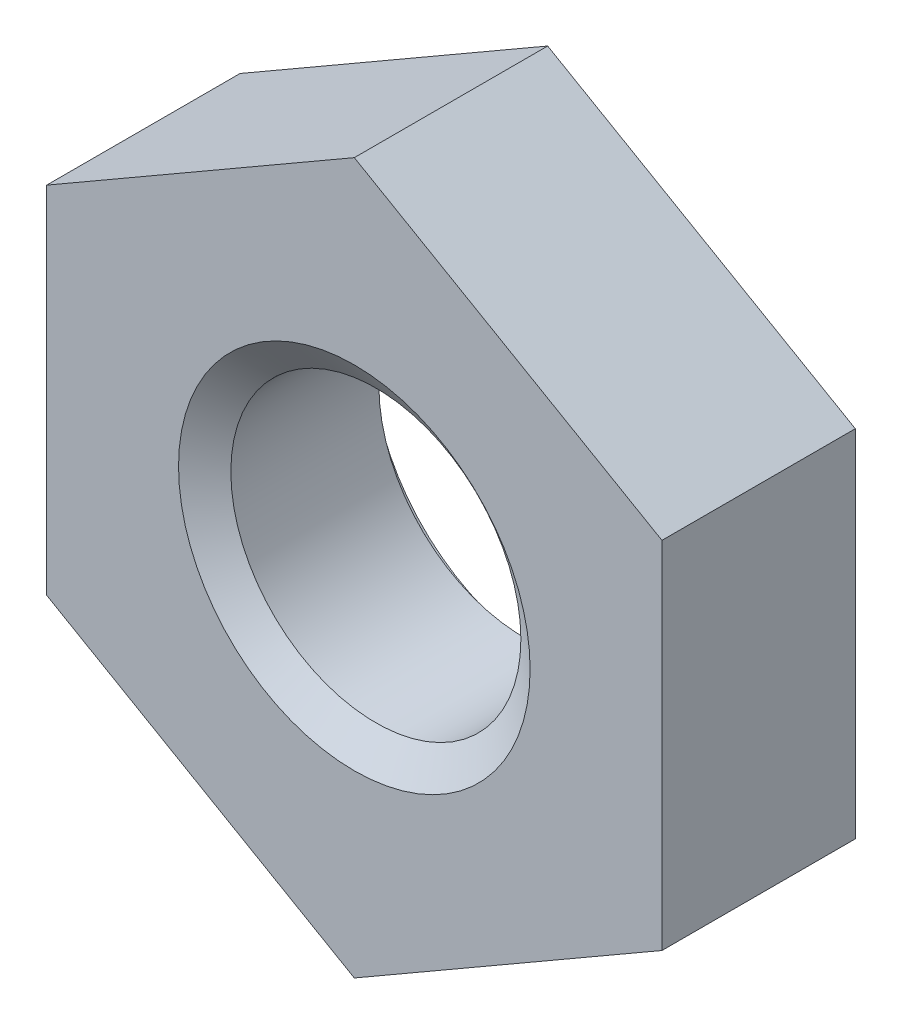
ISO-10303-21;
HEADER;
FILE_DESCRIPTION(('STEP AP214'),'2;1');
FILE_NAME('part.step','',(''),(''),'','','');
FILE_SCHEMA(('AUTOMOTIVE_DESIGN { 1 0 10303 214 1 1 1 1 }'));
ENDSEC;
DATA;
#1=APPLICATION_CONTEXT('core data for automotive mechanical design processes');
#2=APPLICATION_PROTOCOL_DEFINITION('international standard','automotive_design',2000,#1);
#3=PRODUCT_CONTEXT('',#1,'mechanical');
#4=PRODUCT('Part','Part','',(#3));
#5=PRODUCT_RELATED_PRODUCT_CATEGORY('part','',(#4));
#6=PRODUCT_DEFINITION_FORMATION('','',#4);
#7=PRODUCT_DEFINITION_CONTEXT('part definition',#1,'design');
#8=PRODUCT_DEFINITION('design','',#6,#7);
#9=PRODUCT_DEFINITION_SHAPE('','',#8);
#10=(LENGTH_UNIT() NAMED_UNIT(*) SI_UNIT(.MILLI.,.METRE.));
#11=(NAMED_UNIT(*) PLANE_ANGLE_UNIT() SI_UNIT($,.RADIAN.));
#12=(NAMED_UNIT(*) SI_UNIT($,.STERADIAN.) SOLID_ANGLE_UNIT());
#13=UNCERTAINTY_MEASURE_WITH_UNIT(LENGTH_MEASURE(1.E-05),#10,'distance_accuracy_value','');
#14=(GEOMETRIC_REPRESENTATION_CONTEXT(3) GLOBAL_UNCERTAINTY_ASSIGNED_CONTEXT((#13)) GLOBAL_UNIT_ASSIGNED_CONTEXT((#10,
#11,#12)) REPRESENTATION_CONTEXT('',''));
#15=CARTESIAN_POINT('',(0.,0.,0.));
#16=DIRECTION('',(0.,0.,1.));
#17=DIRECTION('',(1.,0.,0.));
#18=AXIS2_PLACEMENT_3D('',#15,#16,#17);
#19=CARTESIAN_POINT('',(0.,0.,-2.2));
#20=DIRECTION('',(0.,0.,1.));
#21=DIRECTION('',(1.,0.,0.));
#22=AXIS2_PLACEMENT_3D('',#19,#20,#21);
#23=CYLINDRICAL_SURFACE('',#22,1.65);
#24=CARTESIAN_POINT('',(0.,0.,-0.245072638373399));
#25=DIRECTION('',(0.,0.,1.));
#26=DIRECTION('',(1.,0.,0.));
#27=AXIS2_PLACEMENT_3D('',#24,#25,#26);
#28=CIRCLE('',#27,1.65);
#29=CARTESIAN_POINT('',(1.65,0.,-0.245072638373399));
#30=VERTEX_POINT('',#29);
#31=EDGE_CURVE('E126',#30,#30,#28,.F.);
#32=ORIENTED_EDGE('',*,*,#31,.F.);
#33=EDGE_LOOP('',(#32));
#34=FACE_BOUND('',#33,.T.);
#35=CARTESIAN_POINT('',(0.,0.,-1.9295273616266));
#36=DIRECTION('',(0.,0.,-1.));
#37=DIRECTION('',(-1.,0.,0.));
#38=AXIS2_PLACEMENT_3D('',#35,#36,#37);
#39=CIRCLE('',#38,1.65);
#40=CARTESIAN_POINT('',(-1.65,0.,-1.9295273616266));
#41=VERTEX_POINT('',#40);
#42=EDGE_CURVE('E39',#41,#41,#39,.F.);
#43=ORIENTED_EDGE('',*,*,#42,.F.);
#44=EDGE_LOOP('',(#43));
#45=FACE_BOUND('',#44,.T.);
#46=ADVANCED_FACE('F35',(#34,#45),#23,.F.);
#47=CARTESIAN_POINT('',(0.,4.04145188432738,-2.2));
#48=DIRECTION('',(-0.500000000000001,0.866025403784438,0.));
#49=DIRECTION('',(-0.866025403784438,-0.500000000000001,0.));
#50=AXIS2_PLACEMENT_3D('',#47,#48,#49);
#51=PLANE('',#50);
#52=DIRECTION('',(-0.866025403784438,-0.500000000000001,0.));
#53=VECTOR('',#52,1.);
#54=CARTESIAN_POINT('',(0.,4.04145188432738,0.));
#55=LINE('',#54,#53);
#56=CARTESIAN_POINT('',(0.,4.04145188432738,0.));
#57=VERTEX_POINT('',#56);
#58=CARTESIAN_POINT('',(-3.5,2.02072594216369,0.));
#59=VERTEX_POINT('',#58);
#60=EDGE_CURVE('E122',#57,#59,#55,.T.);
#61=ORIENTED_EDGE('',*,*,#60,.F.);
#62=DIRECTION('',(0.,0.,1.));
#63=VECTOR('',#62,1.);
#64=CARTESIAN_POINT('',(0.,4.04145188432738,-2.2));
#65=LINE('',#64,#63);
#66=CARTESIAN_POINT('',(0.,4.04145188432738,-2.2));
#67=VERTEX_POINT('',#66);
#68=EDGE_CURVE('E11',#67,#57,#65,.T.);
#69=ORIENTED_EDGE('',*,*,#68,.F.);
#70=DIRECTION('',(-0.866025403784438,-0.500000000000001,0.));
#71=VECTOR('',#70,1.);
#72=CARTESIAN_POINT('',(0.,4.04145188432738,-2.2));
#73=LINE('',#72,#71);
#74=CARTESIAN_POINT('',(-3.5,2.02072594216369,-2.2));
#75=VERTEX_POINT('',#74);
#76=EDGE_CURVE('E137',#67,#75,#73,.T.);
#77=ORIENTED_EDGE('',*,*,#76,.T.);
#78=DIRECTION('',(0.,0.,1.));
#79=VECTOR('',#78,1.);
#80=CARTESIAN_POINT('',(-3.5,2.02072594216369,-2.2));
#81=LINE('',#80,#79);
#82=EDGE_CURVE('E86',#75,#59,#81,.T.);
#83=ORIENTED_EDGE('',*,*,#82,.T.);
#84=EDGE_LOOP('',(#61,#69,#77,#83));
#85=FACE_BOUND('',#84,.T.);
#86=ADVANCED_FACE('F37',(#85),#51,.T.);
#87=CARTESIAN_POINT('',(3.5,2.02072594216369,-2.2));
#88=DIRECTION('',(0.500000000000001,0.866025403784438,0.));
#89=DIRECTION('',(-0.866025403784438,0.500000000000001,0.));
#90=AXIS2_PLACEMENT_3D('',#87,#88,#89);
#91=PLANE('',#90);
#92=DIRECTION('',(-0.866025403784438,0.500000000000001,0.));
#93=VECTOR('',#92,1.);
#94=CARTESIAN_POINT('',(3.5,2.02072594216369,0.));
#95=LINE('',#94,#93);
#96=CARTESIAN_POINT('',(3.5,2.02072594216369,0.));
#97=VERTEX_POINT('',#96);
#98=EDGE_CURVE('E135',#97,#57,#95,.T.);
#99=ORIENTED_EDGE('',*,*,#98,.F.);
#100=DIRECTION('',(0.,0.,1.));
#101=VECTOR('',#100,1.);
#102=CARTESIAN_POINT('',(3.5,2.02072594216369,-2.2));
#103=LINE('',#102,#101);
#104=CARTESIAN_POINT('',(3.5,2.02072594216369,-2.2));
#105=VERTEX_POINT('',#104);
#106=EDGE_CURVE('E45',#105,#97,#103,.T.);
#107=ORIENTED_EDGE('',*,*,#106,.F.);
#108=DIRECTION('',(-0.866025403784438,0.500000000000001,0.));
#109=VECTOR('',#108,1.);
#110=CARTESIAN_POINT('',(3.5,2.02072594216369,-2.2));
#111=LINE('',#110,#109);
#112=EDGE_CURVE('E104',#105,#67,#111,.T.);
#113=ORIENTED_EDGE('',*,*,#112,.T.);
#114=ORIENTED_EDGE('',*,*,#68,.T.);
#115=EDGE_LOOP('',(#99,#107,#113,#114));
#116=FACE_BOUND('',#115,.T.);
#117=ADVANCED_FACE('F163',(#116),#91,.T.);
#118=CARTESIAN_POINT('',(3.5,2.02072594216369,-2.2));
#119=DIRECTION('',(-1.,0.,0.));
#120=DIRECTION('',(0.,0.,1.));
#121=AXIS2_PLACEMENT_3D('',#118,#119,#120);
#122=PLANE('',#121);
#123=DIRECTION('',(0.,-1.,0.));
#124=VECTOR('',#123,1.);
#125=CARTESIAN_POINT('',(3.5,2.02072594216369,0.));
#126=LINE('',#125,#124);
#127=CARTESIAN_POINT('',(3.5,-2.02072594216369,0.));
#128=VERTEX_POINT('',#127);
#129=EDGE_CURVE('E108',#97,#128,#126,.T.);
#130=ORIENTED_EDGE('',*,*,#129,.T.);
#131=DIRECTION('',(0.,0.,1.));
#132=VECTOR('',#131,1.);
#133=CARTESIAN_POINT('',(3.5,-2.02072594216369,-2.2));
#134=LINE('',#133,#132);
#135=CARTESIAN_POINT('',(3.5,-2.02072594216369,-2.2));
#136=VERTEX_POINT('',#135);
#137=EDGE_CURVE('E106',#136,#128,#134,.T.);
#138=ORIENTED_EDGE('',*,*,#137,.F.);
#139=DIRECTION('',(0.,-1.,0.));
#140=VECTOR('',#139,1.);
#141=CARTESIAN_POINT('',(3.5,2.02072594216369,-2.2));
#142=LINE('',#141,#140);
#143=EDGE_CURVE('E97',#105,#136,#142,.T.);
#144=ORIENTED_EDGE('',*,*,#143,.F.);
#145=ORIENTED_EDGE('',*,*,#106,.T.);
#146=EDGE_LOOP('',(#130,#138,#144,#145));
#147=FACE_BOUND('',#146,.T.);
#148=ADVANCED_FACE('F107',(#147),#122,.F.);
#149=CARTESIAN_POINT('',(0.,-4.04145188432739,-2.2));
#150=DIRECTION('',(0.500000000000001,-0.866025403784438,0.));
#151=DIRECTION('',(0.866025403784438,0.500000000000001,0.));
#152=AXIS2_PLACEMENT_3D('',#149,#150,#151);
#153=PLANE('',#152);
#154=DIRECTION('',(0.866025403784438,0.500000000000001,0.));
#155=VECTOR('',#154,1.);
#156=CARTESIAN_POINT('',(0.,-4.04145188432739,0.));
#157=LINE('',#156,#155);
#158=CARTESIAN_POINT('',(0.,-4.04145188432739,0.));
#159=VERTEX_POINT('',#158);
#160=EDGE_CURVE('E132',#159,#128,#157,.T.);
#161=ORIENTED_EDGE('',*,*,#160,.F.);
#162=DIRECTION('',(0.,0.,1.));
#163=VECTOR('',#162,1.);
#164=CARTESIAN_POINT('',(0.,-4.04145188432739,-2.2));
#165=LINE('',#164,#163);
#166=CARTESIAN_POINT('',(0.,-4.04145188432739,-2.2));
#167=VERTEX_POINT('',#166);
#168=EDGE_CURVE('E112',#167,#159,#165,.T.);
#169=ORIENTED_EDGE('',*,*,#168,.F.);
#170=DIRECTION('',(0.866025403784438,0.500000000000001,0.));
#171=VECTOR('',#170,1.);
#172=CARTESIAN_POINT('',(0.,-4.04145188432739,-2.2));
#173=LINE('',#172,#171);
#174=EDGE_CURVE('E102',#167,#136,#173,.T.);
#175=ORIENTED_EDGE('',*,*,#174,.T.);
#176=ORIENTED_EDGE('',*,*,#137,.T.);
#177=EDGE_LOOP('',(#161,#169,#175,#176));
#178=FACE_BOUND('',#177,.T.);
#179=ADVANCED_FACE('F114',(#178),#153,.T.);
#180=CARTESIAN_POINT('',(-3.5,-2.02072594216369,-2.2));
#181=DIRECTION('',(-0.500000000000001,-0.866025403784438,0.));
#182=DIRECTION('',(0.866025403784438,-0.500000000000001,0.));
#183=AXIS2_PLACEMENT_3D('',#180,#181,#182);
#184=PLANE('',#183);
#185=DIRECTION('',(0.866025403784438,-0.500000000000001,0.));
#186=VECTOR('',#185,1.);
#187=CARTESIAN_POINT('',(-3.5,-2.02072594216369,0.));
#188=LINE('',#187,#186);
#189=CARTESIAN_POINT('',(-3.5,-2.02072594216369,0.));
#190=VERTEX_POINT('',#189);
#191=EDGE_CURVE('E129',#190,#159,#188,.T.);
#192=ORIENTED_EDGE('',*,*,#191,.F.);
#193=DIRECTION('',(0.,0.,1.));
#194=VECTOR('',#193,1.);
#195=CARTESIAN_POINT('',(-3.5,-2.02072594216369,-2.2));
#196=LINE('',#195,#194);
#197=CARTESIAN_POINT('',(-3.5,-2.02072594216369,-2.2));
#198=VERTEX_POINT('',#197);
#199=EDGE_CURVE('E141',#198,#190,#196,.T.);
#200=ORIENTED_EDGE('',*,*,#199,.F.);
#201=DIRECTION('',(0.866025403784438,-0.500000000000001,0.));
#202=VECTOR('',#201,1.);
#203=CARTESIAN_POINT('',(-3.5,-2.02072594216369,-2.2));
#204=LINE('',#203,#202);
#205=EDGE_CURVE('E115',#198,#167,#204,.T.);
#206=ORIENTED_EDGE('',*,*,#205,.T.);
#207=ORIENTED_EDGE('',*,*,#168,.T.);
#208=EDGE_LOOP('',(#192,#200,#206,#207));
#209=FACE_BOUND('',#208,.T.);
#210=ADVANCED_FACE('F240',(#209),#184,.T.);
#211=CARTESIAN_POINT('',(-3.5,2.02072594216369,-2.2));
#212=DIRECTION('',(-1.,0.,0.));
#213=DIRECTION('',(0.,0.,1.));
#214=AXIS2_PLACEMENT_3D('',#211,#212,#213);
#215=PLANE('',#214);
#216=DIRECTION('',(0.,-1.,0.));
#217=VECTOR('',#216,1.);
#218=CARTESIAN_POINT('',(-3.5,2.02072594216369,0.));
#219=LINE('',#218,#217);
#220=EDGE_CURVE('E125',#59,#190,#219,.T.);
#221=ORIENTED_EDGE('',*,*,#220,.F.);
#222=ORIENTED_EDGE('',*,*,#82,.F.);
#223=DIRECTION('',(0.,-1.,0.));
#224=VECTOR('',#223,1.);
#225=CARTESIAN_POINT('',(-3.5,2.02072594216369,-2.2));
#226=LINE('',#225,#224);
#227=EDGE_CURVE('E117',#75,#198,#226,.T.);
#228=ORIENTED_EDGE('',*,*,#227,.T.);
#229=ORIENTED_EDGE('',*,*,#199,.T.);
#230=EDGE_LOOP('',(#221,#222,#228,#229));
#231=FACE_BOUND('',#230,.T.);
#232=ADVANCED_FACE('F159',(#231),#215,.T.);
#233=CARTESIAN_POINT('',(0.,4.04145188432738,-2.2));
#234=DIRECTION('',(0.,0.,-1.));
#235=DIRECTION('',(-1.,0.,0.));
#236=AXIS2_PLACEMENT_3D('',#233,#234,#235);
#237=PLANE('',#236);
#238=CARTESIAN_POINT('',(0.,0.,-2.2));
#239=DIRECTION('',(0.,0.,-1.));
#240=DIRECTION('',(-1.,0.,0.));
#241=AXIS2_PLACEMENT_3D('',#238,#239,#240);
#242=CIRCLE('',#241,2.);
#243=CARTESIAN_POINT('',(-2.,0.,-2.2));
#244=VERTEX_POINT('',#243);
#245=EDGE_CURVE('E146',#244,#244,#242,.F.);
#246=ORIENTED_EDGE('',*,*,#245,.T.);
#247=EDGE_LOOP('',(#246));
#248=FACE_BOUND('',#247,.T.);
#249=ORIENTED_EDGE('',*,*,#76,.F.);
#250=ORIENTED_EDGE('',*,*,#112,.F.);
#251=ORIENTED_EDGE('',*,*,#143,.T.);
#252=ORIENTED_EDGE('',*,*,#174,.F.);
#253=ORIENTED_EDGE('',*,*,#205,.F.);
#254=ORIENTED_EDGE('',*,*,#227,.F.);
#255=EDGE_LOOP('',(#249,#250,#251,#252,#253,#254));
#256=FACE_BOUND('',#255,.T.);
#257=ADVANCED_FACE('F99',(#248,#256),#237,.T.);
#258=CARTESIAN_POINT('',(0.,4.04145188432738,0.));
#259=DIRECTION('',(0.,0.,-1.));
#260=DIRECTION('',(-1.,0.,0.));
#261=AXIS2_PLACEMENT_3D('',#258,#259,#260);
#262=PLANE('',#261);
#263=CARTESIAN_POINT('',(0.,0.,0.));
#264=DIRECTION('',(0.,0.,1.));
#265=DIRECTION('',(1.,0.,0.));
#266=AXIS2_PLACEMENT_3D('',#263,#264,#265);
#267=CIRCLE('',#266,2.);
#268=CARTESIAN_POINT('',(2.,0.,0.));
#269=VERTEX_POINT('',#268);
#270=EDGE_CURVE('E145',#269,#269,#267,.T.);
#271=ORIENTED_EDGE('',*,*,#270,.F.);
#272=EDGE_LOOP('',(#271));
#273=FACE_BOUND('',#272,.T.);
#274=ORIENTED_EDGE('',*,*,#60,.T.);
#275=ORIENTED_EDGE('',*,*,#220,.T.);
#276=ORIENTED_EDGE('',*,*,#191,.T.);
#277=ORIENTED_EDGE('',*,*,#160,.T.);
#278=ORIENTED_EDGE('',*,*,#129,.F.);
#279=ORIENTED_EDGE('',*,*,#98,.T.);
#280=EDGE_LOOP('',(#274,#275,#276,#277,#278,#279));
#281=FACE_BOUND('',#280,.T.);
#282=ADVANCED_FACE('F162',(#273,#281),#262,.F.);
#283=CARTESIAN_POINT('',(0.,0.,-0.269579902210739));
#284=DIRECTION('',(0.,0.,1.));
#285=DIRECTION('',(1.,0.,0.));
#286=AXIS2_PLACEMENT_3D('',#283,#284,#285);
#287=CONICAL_SURFACE('',#286,1.615,0.95993108859688);
#288=ORIENTED_EDGE('',*,*,#270,.T.);
#289=EDGE_LOOP('',(#288));
#290=FACE_BOUND('',#289,.T.);
#291=ORIENTED_EDGE('',*,*,#31,.T.);
#292=EDGE_LOOP('',(#291));
#293=FACE_BOUND('',#292,.T.);
#294=ADVANCED_FACE('F181',(#290,#293),#287,.F.);
#295=CARTESIAN_POINT('',(0.,0.,-2.1746));
#296=DIRECTION('',(0.,0.,-1.));
#297=DIRECTION('',(-1.,0.,0.));
#298=AXIS2_PLACEMENT_3D('',#295,#296,#297);
#299=CONICAL_SURFACE('',#298,2.,0.95993108859688);
#300=CARTESIAN_POINT('',(0.,0.,-2.1746));
#301=DIRECTION('',(0.,0.,1.));
#302=DIRECTION('',(1.,0.,0.));
#303=AXIS2_PLACEMENT_3D('',#300,#301,#302);
#304=CIRCLE('',#303,2.);
#305=CARTESIAN_POINT('',(2.,0.,-2.1746));
#306=VERTEX_POINT('',#305);
#307=EDGE_CURVE('E148',#306,#306,#304,.T.);
#308=ORIENTED_EDGE('',*,*,#307,.F.);
#309=EDGE_LOOP('',(#308));
#310=FACE_BOUND('',#309,.T.);
#311=ORIENTED_EDGE('',*,*,#42,.T.);
#312=EDGE_LOOP('',(#311));
#313=FACE_BOUND('',#312,.T.);
#314=ADVANCED_FACE('F189',(#310,#313),#299,.F.);
#315=CARTESIAN_POINT('',(0.,0.,-25.0375057290932));
#316=DIRECTION('',(0.,0.,1.));
#317=DIRECTION('',(1.,0.,0.));
#318=AXIS2_PLACEMENT_3D('',#315,#316,#317);
#319=CYLINDRICAL_SURFACE('',#318,2.);
#320=ORIENTED_EDGE('',*,*,#245,.F.);
#321=EDGE_LOOP('',(#320));
#322=FACE_BOUND('',#321,.T.);
#323=ORIENTED_EDGE('',*,*,#307,.T.);
#324=EDGE_LOOP('',(#323));
#325=FACE_BOUND('',#324,.T.);
#326=ADVANCED_FACE('F196',(#322,#325),#319,.F.);
#327=CLOSED_SHELL('',(#46,#86,#117,#148,#179,#210,#232,#257,#282,#294,#314,#326));
#328=MANIFOLD_SOLID_BREP('B2',#327);
#329=ADVANCED_BREP_SHAPE_REPRESENTATION('',(#18,#328),#14);
#330=SHAPE_DEFINITION_REPRESENTATION(#9,#329);
ENDSEC;
END-ISO-10303-21;
